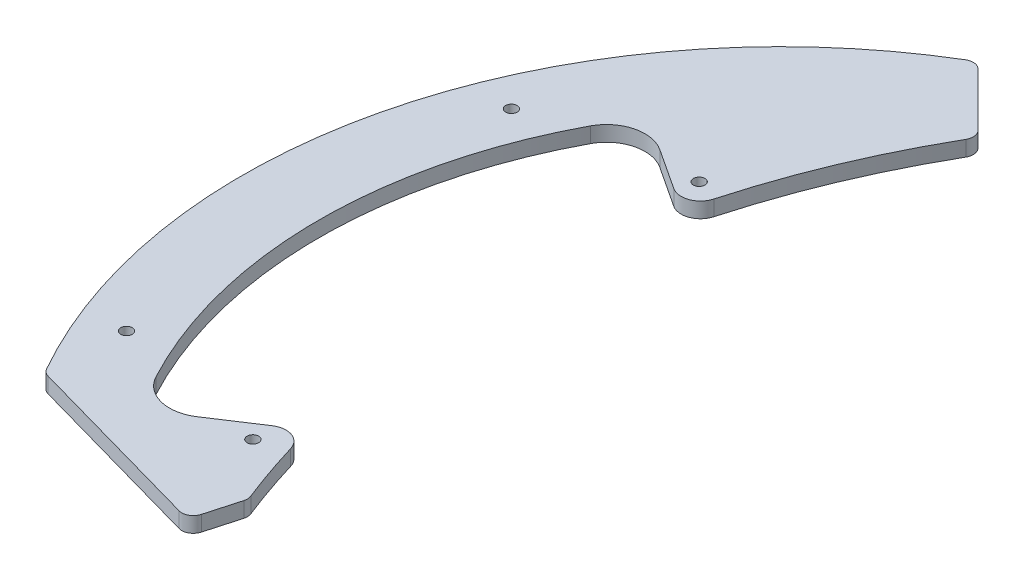
ISO-10303-21;
HEADER;
FILE_DESCRIPTION(('STEP AP214'),'2;1');
FILE_NAME('part.step','',(''),(''),'','','');
FILE_SCHEMA(('AUTOMOTIVE_DESIGN { 1 0 10303 214 1 1 1 1 }'));
ENDSEC;
DATA;
#1=APPLICATION_CONTEXT('core data for automotive mechanical design processes');
#2=APPLICATION_PROTOCOL_DEFINITION('international standard','automotive_design',2000,#1);
#3=PRODUCT_CONTEXT('',#1,'mechanical');
#4=PRODUCT('Part','Part','',(#3));
#5=PRODUCT_RELATED_PRODUCT_CATEGORY('part','',(#4));
#6=PRODUCT_DEFINITION_FORMATION('','',#4);
#7=PRODUCT_DEFINITION_CONTEXT('part definition',#1,'design');
#8=PRODUCT_DEFINITION('design','',#6,#7);
#9=PRODUCT_DEFINITION_SHAPE('','',#8);
#10=(LENGTH_UNIT() NAMED_UNIT(*) SI_UNIT(.MILLI.,.METRE.));
#11=(NAMED_UNIT(*) PLANE_ANGLE_UNIT() SI_UNIT($,.RADIAN.));
#12=(NAMED_UNIT(*) SI_UNIT($,.STERADIAN.) SOLID_ANGLE_UNIT());
#13=UNCERTAINTY_MEASURE_WITH_UNIT(LENGTH_MEASURE(1.E-05),#10,'distance_accuracy_value','');
#14=(GEOMETRIC_REPRESENTATION_CONTEXT(3) GLOBAL_UNCERTAINTY_ASSIGNED_CONTEXT((#13)) GLOBAL_UNIT_ASSIGNED_CONTEXT((#10,
#11,#12)) REPRESENTATION_CONTEXT('',''));
#15=CARTESIAN_POINT('',(0.,0.,0.));
#16=DIRECTION('',(0.,0.,1.));
#17=DIRECTION('',(1.,0.,0.));
#18=AXIS2_PLACEMENT_3D('',#15,#16,#17);
#19=CARTESIAN_POINT('',(119.292781216644,442.462940593629,-2.48826461253128));
#20=DIRECTION('',(0.,-1.,0.));
#21=DIRECTION('',(0.,0.,-1.));
#22=AXIS2_PLACEMENT_3D('',#19,#20,#21);
#23=CYLINDRICAL_SURFACE('',#22,200.);
#24=CARTESIAN_POINT('',(119.292781216644,4.,-2.48826461253128));
#25=DIRECTION('',(0.,1.,0.));
#26=DIRECTION('',(0.,0.,1.));
#27=AXIS2_PLACEMENT_3D('',#24,#25,#26);
#28=CIRCLE('',#27,200.);
#29=CARTESIAN_POINT('',(-66.7091969028402,4.,71.0186339456232));
#30=VERTEX_POINT('',#29);
#31=CARTESIAN_POINT('',(-72.2325146751866,4.,55.1143484666219));
#32=VERTEX_POINT('',#31);
#33=EDGE_CURVE('E191',#30,#32,#28,.F.);
#34=ORIENTED_EDGE('',*,*,#33,.F.);
#35=DIRECTION('',(0.,-1.,0.));
#36=VECTOR('',#35,1.);
#37=CARTESIAN_POINT('',(-66.7091969028402,442.462940593629,71.0186339456232));
#38=LINE('',#37,#36);
#39=CARTESIAN_POINT('',(-66.7091969028402,0.,71.0186339456232));
#40=VERTEX_POINT('',#39);
#41=EDGE_CURVE('E287',#30,#40,#38,.T.);
#42=ORIENTED_EDGE('',*,*,#41,.T.);
#43=CARTESIAN_POINT('',(119.292781216644,0.,-2.48826461253128));
#44=DIRECTION('',(0.,1.,0.));
#45=DIRECTION('',(0.,0.,1.));
#46=AXIS2_PLACEMENT_3D('',#43,#44,#45);
#47=CIRCLE('',#46,200.);
#48=CARTESIAN_POINT('',(-72.2325146751866,0.,55.1143484666219));
#49=VERTEX_POINT('',#48);
#50=EDGE_CURVE('E184',#40,#49,#47,.F.);
#51=ORIENTED_EDGE('',*,*,#50,.T.);
#52=DIRECTION('',(0.,-1.,0.));
#53=VECTOR('',#52,1.);
#54=CARTESIAN_POINT('',(-72.2325146751866,442.462940593629,55.1143484666219));
#55=LINE('',#54,#53);
#56=EDGE_CURVE('E234',#49,#32,#55,.F.);
#57=ORIENTED_EDGE('',*,*,#56,.T.);
#58=EDGE_LOOP('',(#34,#42,#51,#57));
#59=FACE_BOUND('',#58,.T.);
#60=ADVANCED_FACE('F33',(#59),#23,.F.);
#61=CARTESIAN_POINT('',(0.,4.,0.));
#62=DIRECTION('',(0.,1.,0.));
#63=DIRECTION('',(0.,0.,1.));
#64=AXIS2_PLACEMENT_3D('',#61,#62,#63);
#65=PLANE('',#64);
#66=CARTESIAN_POINT('',(-120.,4.,50.));
#67=DIRECTION('',(0.,1.,0.));
#68=DIRECTION('',(0.,0.,1.));
#69=AXIS2_PLACEMENT_3D('',#66,#67,#68);
#70=CIRCLE('',#69,1.5);
#71=CARTESIAN_POINT('',(-120.,4.,51.5));
#72=VERTEX_POINT('',#71);
#73=EDGE_CURVE('E441',#72,#72,#70,.T.);
#74=ORIENTED_EDGE('',*,*,#73,.F.);
#75=EDGE_LOOP('',(#74));
#76=FACE_BOUND('',#75,.T.);
#77=CARTESIAN_POINT('',(-120.,4.,-50.));
#78=DIRECTION('',(0.,1.,0.));
#79=DIRECTION('',(0.,0.,1.));
#80=AXIS2_PLACEMENT_3D('',#77,#78,#79);
#81=CIRCLE('',#80,1.5);
#82=CARTESIAN_POINT('',(-120.,4.,-48.5));
#83=VERTEX_POINT('',#82);
#84=EDGE_CURVE('E433',#83,#83,#81,.T.);
#85=ORIENTED_EDGE('',*,*,#84,.F.);
#86=EDGE_LOOP('',(#85));
#87=FACE_BOUND('',#86,.T.);
#88=CARTESIAN_POINT('',(-73.4125931453854,4.,-56.0105841810066));
#89=VERTEX_POINT('',#88);
#90=CARTESIAN_POINT('',(-54.0840870386816,4.,-102.190127955076));
#91=VERTEX_POINT('',#90);
#92=EDGE_CURVE('E178',#89,#91,#28,.F.);
#93=ORIENTED_EDGE('',*,*,#92,.T.);
#94=CARTESIAN_POINT('',(-56.6847400625115,4.,-103.685655905214));
#95=DIRECTION('',(0.,1.,0.));
#96=DIRECTION('',(0.,0.,1.));
#97=AXIS2_PLACEMENT_3D('',#94,#95,#96);
#98=CIRCLE('',#97,3.);
#99=CARTESIAN_POINT('',(-54.5634197189519,4.,-105.806976248773));
#100=VERTEX_POINT('',#99);
#101=EDGE_CURVE('E280',#91,#100,#98,.T.);
#102=ORIENTED_EDGE('',*,*,#101,.T.);
#103=DIRECTION('',(0.707106781186548,0.,0.707106781186547));
#104=VECTOR('',#103,1.);
#105=CARTESIAN_POINT('',(-70.,4.,-121.243556529821));
#106=LINE('',#105,#104);
#107=CARTESIAN_POINT('',(-68.3581583039485,4.,-119.60171483377));
#108=VERTEX_POINT('',#107);
#109=EDGE_CURVE('E197',#108,#100,#106,.T.);
#110=ORIENTED_EDGE('',*,*,#109,.F.);
#111=CARTESIAN_POINT('',(-70.4794786475082,4.,-117.48039449021));
#112=DIRECTION('',(0.,1.,0.));
#113=DIRECTION('',(0.,0.,1.));
#114=AXIS2_PLACEMENT_3D('',#111,#112,#113);
#115=CIRCLE('',#114,3.);
#116=CARTESIAN_POINT('',(-72.0228248952639,4.,-120.052957873208));
#117=VERTEX_POINT('',#116);
#118=EDGE_CURVE('E278',#108,#117,#115,.T.);
#119=ORIENTED_EDGE('',*,*,#118,.T.);
#120=CARTESIAN_POINT('',(0.,4.,0.));
#121=DIRECTION('',(0.,1.,0.));
#122=DIRECTION('',(0.,0.,1.));
#123=AXIS2_PLACEMENT_3D('',#120,#121,#122);
#124=CIRCLE('',#123,140.);
#125=CARTESIAN_POINT('',(-121.860234865542,4.,68.9208470530874));
#126=VERTEX_POINT('',#125);
#127=EDGE_CURVE('E219',#117,#126,#124,.T.);
#128=ORIENTED_EDGE('',*,*,#127,.T.);
#129=CARTESIAN_POINT('',(-119.248944118423,4.,67.4439717590927));
#130=DIRECTION('',(0.,1.,0.));
#131=DIRECTION('',(0.,0.,1.));
#132=AXIS2_PLACEMENT_3D('',#129,#130,#131);
#133=CIRCLE('',#132,3.);
#134=CARTESIAN_POINT('',(-120.059781260619,4.,70.3323178479186));
#135=VERTEX_POINT('',#134);
#136=EDGE_CURVE('E273',#126,#135,#133,.T.);
#137=ORIENTED_EDGE('',*,*,#136,.T.);
#138=DIRECTION('',(0.962782029608611,0.,0.270279047398653));
#139=VECTOR('',#138,1.);
#140=CARTESIAN_POINT('',(-50.,4.,90.));
#141=LINE('',#140,#139);
#142=CARTESIAN_POINT('',(-72.7272013836813,4.,83.6198577132606));
#143=VERTEX_POINT('',#142);
#144=EDGE_CURVE('E212',#135,#143,#141,.T.);
#145=ORIENTED_EDGE('',*,*,#144,.T.);
#146=CARTESIAN_POINT('',(-71.9163642414853,4.,80.7315116244347));
#147=DIRECTION('',(0.,1.,0.));
#148=DIRECTION('',(0.,0.,1.));
#149=AXIS2_PLACEMENT_3D('',#146,#147,#148);
#150=CIRCLE('',#149,3.);
#151=CARTESIAN_POINT('',(-69.0280181526595,4.,81.5423487666307));
#152=VERTEX_POINT('',#151);
#153=EDGE_CURVE('E275',#143,#152,#150,.T.);
#154=ORIENTED_EDGE('',*,*,#153,.T.);
#155=DIRECTION('',(0.270279047398657,0.,-0.96278202960861));
#156=VECTOR('',#155,1.);
#157=CARTESIAN_POINT('',(-42.7665342383547,4.,-12.0057269236563));
#158=LINE('',#157,#156);
#159=CARTESIAN_POINT('',(-66.6108804858067,4.,72.9320745661915));
#160=VERTEX_POINT('',#159);
#161=EDGE_CURVE('E195',#152,#160,#158,.T.);
#162=ORIENTED_EDGE('',*,*,#161,.T.);
#163=CARTESIAN_POINT('',(-69.4992265746324,4.,72.1212374239956));
#164=DIRECTION('',(0.,1.,0.));
#165=DIRECTION('',(0.,0.,1.));
#166=AXIS2_PLACEMENT_3D('',#163,#164,#165);
#167=CIRCLE('',#166,3.);
#168=EDGE_CURVE('E48',#160,#30,#167,.T.);
#169=ORIENTED_EDGE('',*,*,#168,.T.);
#170=ORIENTED_EDGE('',*,*,#33,.T.);
#171=CARTESIAN_POINT('',(-77.0206470724824,4.,56.5544137936007));
#172=DIRECTION('',(0.,1.,0.));
#173=DIRECTION('',(0.,0.,1.));
#174=AXIS2_PLACEMENT_3D('',#171,#172,#173);
#175=CIRCLE('',#174,5.);
#176=CARTESIAN_POINT('',(-79.7649948281515,4.,52.3748736997681));
#177=VERTEX_POINT('',#176);
#178=EDGE_CURVE('E229',#32,#177,#175,.T.);
#179=ORIENTED_EDGE('',*,*,#178,.T.);
#180=DIRECTION('',(0.835908018766511,0.,-0.548869551133825));
#181=VECTOR('',#180,1.);
#182=CARTESIAN_POINT('',(-100.308962251981,4.,65.864346136059));
#183=LINE('',#182,#181);
#184=CARTESIAN_POINT('',(-91.569135575574,4.,60.1256468567463));
#185=VERTEX_POINT('',#184);
#186=EDGE_CURVE('E326',#185,#177,#183,.T.);
#187=ORIENTED_EDGE('',*,*,#186,.F.);
#188=CARTESIAN_POINT('',(-97.0578310869122,4.,51.7665666690812));
#189=DIRECTION('',(0.,1.,0.));
#190=DIRECTION('',(0.,0.,1.));
#191=AXIS2_PLACEMENT_3D('',#188,#189,#190);
#192=CIRCLE('',#191,10.);
#193=CARTESIAN_POINT('',(-105.881270276631,4.,56.4726181844522));
#194=VERTEX_POINT('',#193);
#195=EDGE_CURVE('E253',#185,#194,#192,.F.);
#196=ORIENTED_EDGE('',*,*,#195,.T.);
#197=CARTESIAN_POINT('',(0.,4.,0.));
#198=DIRECTION('',(0.,1.,0.));
#199=DIRECTION('',(0.,0.,1.));
#200=AXIS2_PLACEMENT_3D('',#197,#198,#199);
#201=CIRCLE('',#200,120.);
#202=CARTESIAN_POINT('',(-105.881270276631,4.,-56.4726181844522));
#203=VERTEX_POINT('',#202);
#204=EDGE_CURVE('E187',#203,#194,#201,.T.);
#205=ORIENTED_EDGE('',*,*,#204,.F.);
#206=CARTESIAN_POINT('',(-97.0578310869122,4.,-51.7665666690812));
#207=DIRECTION('',(0.,1.,0.));
#208=DIRECTION('',(0.,0.,1.));
#209=AXIS2_PLACEMENT_3D('',#206,#207,#208);
#210=CIRCLE('',#209,10.);
#211=CARTESIAN_POINT('',(-91.569135575574,4.,-60.1256468567463));
#212=VERTEX_POINT('',#211);
#213=EDGE_CURVE('E249',#203,#212,#210,.F.);
#214=ORIENTED_EDGE('',*,*,#213,.T.);
#215=DIRECTION('',(-0.835908018766511,0.,-0.548869551133825));
#216=VECTOR('',#215,1.);
#217=CARTESIAN_POINT('',(0.,4.,0.));
#218=LINE('',#217,#216);
#219=CARTESIAN_POINT('',(-80.9745752601053,4.,-53.1691020763859));
#220=VERTEX_POINT('',#219);
#221=EDGE_CURVE('E330',#220,#212,#218,.T.);
#222=ORIENTED_EDGE('',*,*,#221,.F.);
#223=CARTESIAN_POINT('',(-78.2302275044362,4.,-57.3486421702185));
#224=DIRECTION('',(0.,1.,0.));
#225=DIRECTION('',(0.,0.,1.));
#226=AXIS2_PLACEMENT_3D('',#223,#224,#225);
#227=CIRCLE('',#226,5.);
#228=EDGE_CURVE('E232',#220,#89,#227,.T.);
#229=ORIENTED_EDGE('',*,*,#228,.T.);
#230=EDGE_LOOP('',(#93,#102,#110,#119,#128,#137,#145,#154,#162,#169,#170,#179,#187,#196,#205,
#214,#222,#229));
#231=FACE_BOUND('',#230,.T.);
#232=CARTESIAN_POINT('',(-79.1959594928934,4.,-57.9827560572969));
#233=DIRECTION('',(0.,1.,0.));
#234=DIRECTION('',(0.,0.,1.));
#235=AXIS2_PLACEMENT_3D('',#232,#233,#234);
#236=CIRCLE('',#235,1.49999999999998);
#237=CARTESIAN_POINT('',(-79.1959594928934,4.,-56.482756057297));
#238=VERTEX_POINT('',#237);
#239=EDGE_CURVE('E200',#238,#238,#236,.T.);
#240=ORIENTED_EDGE('',*,*,#239,.F.);
#241=EDGE_LOOP('',(#240));
#242=FACE_BOUND('',#241,.T.);
#243=CARTESIAN_POINT('',(-79.1959594928934,4.,57.982756057297));
#244=DIRECTION('',(0.,1.,0.));
#245=DIRECTION('',(0.,0.,1.));
#246=AXIS2_PLACEMENT_3D('',#243,#244,#245);
#247=CIRCLE('',#246,1.50000000000001);
#248=CARTESIAN_POINT('',(-79.1959594928934,4.,59.482756057297));
#249=VERTEX_POINT('',#248);
#250=EDGE_CURVE('E206',#249,#249,#247,.T.);
#251=ORIENTED_EDGE('',*,*,#250,.F.);
#252=EDGE_LOOP('',(#251));
#253=FACE_BOUND('',#252,.T.);
#254=ADVANCED_FACE('F309',(#76,#87,#231,#242,#253),#65,.T.);
#255=CARTESIAN_POINT('',(0.,0.,0.));
#256=DIRECTION('',(0.,1.,0.));
#257=DIRECTION('',(0.,0.,1.));
#258=AXIS2_PLACEMENT_3D('',#255,#256,#257);
#259=PLANE('',#258);
#260=CARTESIAN_POINT('',(-120.,0.,50.));
#261=DIRECTION('',(0.,1.,0.));
#262=DIRECTION('',(0.,0.,1.));
#263=AXIS2_PLACEMENT_3D('',#260,#261,#262);
#264=CIRCLE('',#263,1.5);
#265=CARTESIAN_POINT('',(-120.,0.,51.5));
#266=VERTEX_POINT('',#265);
#267=EDGE_CURVE('E438',#266,#266,#264,.F.);
#268=ORIENTED_EDGE('',*,*,#267,.F.);
#269=EDGE_LOOP('',(#268));
#270=FACE_BOUND('',#269,.T.);
#271=CARTESIAN_POINT('',(-120.,0.,-50.));
#272=DIRECTION('',(0.,1.,0.));
#273=DIRECTION('',(0.,0.,1.));
#274=AXIS2_PLACEMENT_3D('',#271,#272,#273);
#275=CIRCLE('',#274,1.5);
#276=CARTESIAN_POINT('',(-120.,0.,-48.5));
#277=VERTEX_POINT('',#276);
#278=EDGE_CURVE('E431',#277,#277,#275,.F.);
#279=ORIENTED_EDGE('',*,*,#278,.F.);
#280=EDGE_LOOP('',(#279));
#281=FACE_BOUND('',#280,.T.);
#282=CARTESIAN_POINT('',(-79.1959594928934,0.,-57.9827560572969));
#283=DIRECTION('',(0.,1.,0.));
#284=DIRECTION('',(0.,0.,1.));
#285=AXIS2_PLACEMENT_3D('',#282,#283,#284);
#286=CIRCLE('',#285,1.49999999999998);
#287=CARTESIAN_POINT('',(-79.1959594928934,0.,-56.482756057297));
#288=VERTEX_POINT('',#287);
#289=EDGE_CURVE('E203',#288,#288,#286,.F.);
#290=ORIENTED_EDGE('',*,*,#289,.F.);
#291=EDGE_LOOP('',(#290));
#292=FACE_BOUND('',#291,.T.);
#293=CARTESIAN_POINT('',(-79.1959594928934,0.,57.982756057297));
#294=DIRECTION('',(0.,1.,0.));
#295=DIRECTION('',(0.,0.,1.));
#296=AXIS2_PLACEMENT_3D('',#293,#294,#295);
#297=CIRCLE('',#296,1.50000000000001);
#298=CARTESIAN_POINT('',(-79.1959594928934,0.,59.482756057297));
#299=VERTEX_POINT('',#298);
#300=EDGE_CURVE('E209',#299,#299,#297,.F.);
#301=ORIENTED_EDGE('',*,*,#300,.F.);
#302=EDGE_LOOP('',(#301));
#303=FACE_BOUND('',#302,.T.);
#304=DIRECTION('',(-0.707106781186548,0.,-0.707106781186547));
#305=VECTOR('',#304,1.);
#306=CARTESIAN_POINT('',(25.6217782649107,0.,-25.6217782649108));
#307=LINE('',#306,#305);
#308=CARTESIAN_POINT('',(-54.5634197189519,0.,-105.806976248773));
#309=VERTEX_POINT('',#308);
#310=CARTESIAN_POINT('',(-68.3581583039485,0.,-119.60171483377));
#311=VERTEX_POINT('',#310);
#312=EDGE_CURVE('E179',#309,#311,#307,.T.);
#313=ORIENTED_EDGE('',*,*,#312,.F.);
#314=CARTESIAN_POINT('',(-56.6847400625115,0.,-103.685655905214));
#315=DIRECTION('',(0.,1.,0.));
#316=DIRECTION('',(0.,0.,1.));
#317=AXIS2_PLACEMENT_3D('',#314,#315,#316);
#318=CIRCLE('',#317,3.);
#319=CARTESIAN_POINT('',(-54.0840870386816,0.,-102.190127955076));
#320=VERTEX_POINT('',#319);
#321=EDGE_CURVE('E183',#309,#320,#318,.F.);
#322=ORIENTED_EDGE('',*,*,#321,.T.);
#323=CARTESIAN_POINT('',(-73.4125931453854,0.,-56.0105841810066));
#324=VERTEX_POINT('',#323);
#325=EDGE_CURVE('E175',#324,#320,#47,.F.);
#326=ORIENTED_EDGE('',*,*,#325,.F.);
#327=CARTESIAN_POINT('',(-78.2302275044362,0.,-57.3486421702185));
#328=DIRECTION('',(0.,1.,0.));
#329=DIRECTION('',(0.,0.,1.));
#330=AXIS2_PLACEMENT_3D('',#327,#328,#329);
#331=CIRCLE('',#330,5.);
#332=CARTESIAN_POINT('',(-80.9745752601053,0.,-53.1691020763859));
#333=VERTEX_POINT('',#332);
#334=EDGE_CURVE('E160',#324,#333,#331,.F.);
#335=ORIENTED_EDGE('',*,*,#334,.T.);
#336=DIRECTION('',(0.835908018766511,0.,0.548869551133825));
#337=VECTOR('',#336,1.);
#338=CARTESIAN_POINT('',(0.,0.,0.));
#339=LINE('',#338,#337);
#340=CARTESIAN_POINT('',(-91.569135575574,0.,-60.1256468567463));
#341=VERTEX_POINT('',#340);
#342=EDGE_CURVE('E185',#341,#333,#339,.T.);
#343=ORIENTED_EDGE('',*,*,#342,.F.);
#344=CARTESIAN_POINT('',(-97.0578310869122,0.,-51.7665666690812));
#345=DIRECTION('',(0.,1.,0.));
#346=DIRECTION('',(0.,0.,1.));
#347=AXIS2_PLACEMENT_3D('',#344,#345,#346);
#348=CIRCLE('',#347,10.);
#349=CARTESIAN_POINT('',(-105.881270276631,0.,-56.4726181844522));
#350=VERTEX_POINT('',#349);
#351=EDGE_CURVE('E251',#341,#350,#348,.T.);
#352=ORIENTED_EDGE('',*,*,#351,.T.);
#353=CARTESIAN_POINT('',(0.,0.,0.));
#354=DIRECTION('',(0.,1.,0.));
#355=DIRECTION('',(0.,0.,1.));
#356=AXIS2_PLACEMENT_3D('',#353,#354,#355);
#357=CIRCLE('',#356,120.);
#358=CARTESIAN_POINT('',(-105.881270276631,0.,56.4726181844522));
#359=VERTEX_POINT('',#358);
#360=EDGE_CURVE('E334',#359,#350,#357,.F.);
#361=ORIENTED_EDGE('',*,*,#360,.F.);
#362=CARTESIAN_POINT('',(-97.0578310869122,0.,51.7665666690812));
#363=DIRECTION('',(0.,1.,0.));
#364=DIRECTION('',(0.,0.,1.));
#365=AXIS2_PLACEMENT_3D('',#362,#363,#364);
#366=CIRCLE('',#365,10.);
#367=CARTESIAN_POINT('',(-91.569135575574,0.,60.1256468567463));
#368=VERTEX_POINT('',#367);
#369=EDGE_CURVE('E255',#359,#368,#366,.T.);
#370=ORIENTED_EDGE('',*,*,#369,.T.);
#371=DIRECTION('',(-0.835908018766511,0.,0.548869551133825));
#372=VECTOR('',#371,1.);
#373=CARTESIAN_POINT('',(-100.308962251981,0.,65.864346136059));
#374=LINE('',#373,#372);
#375=CARTESIAN_POINT('',(-79.7649948281515,0.,52.3748736997681));
#376=VERTEX_POINT('',#375);
#377=EDGE_CURVE('E320',#376,#368,#374,.T.);
#378=ORIENTED_EDGE('',*,*,#377,.F.);
#379=CARTESIAN_POINT('',(-77.0206470724824,0.,56.5544137936007));
#380=DIRECTION('',(0.,1.,0.));
#381=DIRECTION('',(0.,0.,1.));
#382=AXIS2_PLACEMENT_3D('',#379,#380,#381);
#383=CIRCLE('',#382,5.);
#384=EDGE_CURVE('E169',#376,#49,#383,.F.);
#385=ORIENTED_EDGE('',*,*,#384,.T.);
#386=ORIENTED_EDGE('',*,*,#50,.F.);
#387=CARTESIAN_POINT('',(-69.4992265746324,0.,72.1212374239956));
#388=DIRECTION('',(0.,1.,0.));
#389=DIRECTION('',(0.,0.,1.));
#390=AXIS2_PLACEMENT_3D('',#387,#388,#389);
#391=CIRCLE('',#390,3.);
#392=CARTESIAN_POINT('',(-66.6108804858067,0.,72.9320745661915));
#393=VERTEX_POINT('',#392);
#394=EDGE_CURVE('E266',#40,#393,#391,.F.);
#395=ORIENTED_EDGE('',*,*,#394,.T.);
#396=DIRECTION('',(0.270279047398657,0.,-0.96278202960861));
#397=VECTOR('',#396,1.);
#398=CARTESIAN_POINT('',(-42.7665342383547,0.,-12.0057269236563));
#399=LINE('',#398,#397);
#400=CARTESIAN_POINT('',(-69.0280181526595,0.,81.5423487666307));
#401=VERTEX_POINT('',#400);
#402=EDGE_CURVE('E193',#401,#393,#399,.T.);
#403=ORIENTED_EDGE('',*,*,#402,.F.);
#404=CARTESIAN_POINT('',(-71.9163642414853,0.,80.7315116244347));
#405=DIRECTION('',(0.,1.,0.));
#406=DIRECTION('',(0.,0.,1.));
#407=AXIS2_PLACEMENT_3D('',#404,#405,#406);
#408=CIRCLE('',#407,3.);
#409=CARTESIAN_POINT('',(-72.7272013836813,0.,83.6198577132606));
#410=VERTEX_POINT('',#409);
#411=EDGE_CURVE('E264',#401,#410,#408,.F.);
#412=ORIENTED_EDGE('',*,*,#411,.T.);
#413=DIRECTION('',(0.962782029608611,0.,0.270279047398653));
#414=VECTOR('',#413,1.);
#415=CARTESIAN_POINT('',(-50.,0.,90.));
#416=LINE('',#415,#414);
#417=CARTESIAN_POINT('',(-120.059781260619,0.,70.3323178479186));
#418=VERTEX_POINT('',#417);
#419=EDGE_CURVE('E215',#418,#410,#416,.T.);
#420=ORIENTED_EDGE('',*,*,#419,.F.);
#421=CARTESIAN_POINT('',(-119.248944118423,0.,67.4439717590927));
#422=DIRECTION('',(0.,1.,0.));
#423=DIRECTION('',(0.,0.,1.));
#424=AXIS2_PLACEMENT_3D('',#421,#422,#423);
#425=CIRCLE('',#424,3.);
#426=CARTESIAN_POINT('',(-121.860234865542,0.,68.9208470530874));
#427=VERTEX_POINT('',#426);
#428=EDGE_CURVE('E262',#418,#427,#425,.F.);
#429=ORIENTED_EDGE('',*,*,#428,.T.);
#430=CARTESIAN_POINT('',(0.,0.,0.));
#431=DIRECTION('',(0.,1.,0.));
#432=DIRECTION('',(0.,0.,1.));
#433=AXIS2_PLACEMENT_3D('',#430,#431,#432);
#434=CIRCLE('',#433,140.);
#435=CARTESIAN_POINT('',(-72.0228248952639,0.,-120.052957873208));
#436=VERTEX_POINT('',#435);
#437=EDGE_CURVE('E218',#436,#427,#434,.T.);
#438=ORIENTED_EDGE('',*,*,#437,.F.);
#439=CARTESIAN_POINT('',(-70.4794786475082,0.,-117.48039449021));
#440=DIRECTION('',(0.,1.,0.));
#441=DIRECTION('',(0.,0.,1.));
#442=AXIS2_PLACEMENT_3D('',#439,#440,#441);
#443=CIRCLE('',#442,3.);
#444=EDGE_CURVE('E268',#436,#311,#443,.F.);
#445=ORIENTED_EDGE('',*,*,#444,.T.);
#446=EDGE_LOOP('',(#313,#322,#326,#335,#343,#352,#361,#370,#378,#385,#386,#395,#403,#412,#420,
#429,#438,#445));
#447=FACE_BOUND('',#446,.T.);
#448=ADVANCED_FACE('F182',(#270,#281,#292,#303,#447),#259,.F.);
#449=CARTESIAN_POINT('',(-50.,4.001,90.));
#450=DIRECTION('',(0.270279047398653,0.,-0.962782029608611));
#451=DIRECTION('',(-0.962782029608611,0.,-0.270279047398653));
#452=AXIS2_PLACEMENT_3D('',#449,#450,#451);
#453=PLANE('',#452);
#454=ORIENTED_EDGE('',*,*,#419,.T.);
#455=DIRECTION('',(0.,-1.,0.));
#456=VECTOR('',#455,1.);
#457=CARTESIAN_POINT('',(-72.7272013836813,4.,83.6198577132606));
#458=LINE('',#457,#456);
#459=EDGE_CURVE('E11',#410,#143,#458,.F.);
#460=ORIENTED_EDGE('',*,*,#459,.T.);
#461=ORIENTED_EDGE('',*,*,#144,.F.);
#462=DIRECTION('',(0.,-1.,0.));
#463=VECTOR('',#462,1.);
#464=CARTESIAN_POINT('',(-120.059781260619,4.001,70.3323178479186));
#465=LINE('',#464,#463);
#466=EDGE_CURVE('E41',#135,#418,#465,.T.);
#467=ORIENTED_EDGE('',*,*,#466,.T.);
#468=EDGE_LOOP('',(#454,#460,#461,#467));
#469=FACE_BOUND('',#468,.T.);
#470=ADVANCED_FACE('F298',(#469),#453,.F.);
#471=CARTESIAN_POINT('',(0.,4.,0.));
#472=DIRECTION('',(0.,-1.,0.));
#473=DIRECTION('',(0.,0.,-1.));
#474=AXIS2_PLACEMENT_3D('',#471,#472,#473);
#475=CYLINDRICAL_SURFACE('',#474,140.);
#476=ORIENTED_EDGE('',*,*,#127,.F.);
#477=DIRECTION('',(0.,-1.,0.));
#478=VECTOR('',#477,1.);
#479=CARTESIAN_POINT('',(-72.0228248952639,4.,-120.052957873208));
#480=LINE('',#479,#478);
#481=EDGE_CURVE('E284',#117,#436,#480,.T.);
#482=ORIENTED_EDGE('',*,*,#481,.T.);
#483=ORIENTED_EDGE('',*,*,#437,.T.);
#484=DIRECTION('',(0.,-1.,0.));
#485=VECTOR('',#484,1.);
#486=CARTESIAN_POINT('',(-121.860234865542,4.,68.9208470530874));
#487=LINE('',#486,#485);
#488=EDGE_CURVE('E282',#427,#126,#487,.F.);
#489=ORIENTED_EDGE('',*,*,#488,.T.);
#490=EDGE_LOOP('',(#476,#482,#483,#489));
#491=FACE_BOUND('',#490,.T.);
#492=ADVANCED_FACE('F382',(#491),#475,.T.);
#493=CARTESIAN_POINT('',(-79.1959594928934,-0.00100000000000013,57.982756057297));
#494=DIRECTION('',(0.,1.,0.));
#495=DIRECTION('',(0.,0.,1.));
#496=AXIS2_PLACEMENT_3D('',#493,#494,#495);
#497=CYLINDRICAL_SURFACE('',#496,1.50000000000001);
#498=ORIENTED_EDGE('',*,*,#250,.T.);
#499=EDGE_LOOP('',(#498));
#500=FACE_BOUND('',#499,.T.);
#501=ORIENTED_EDGE('',*,*,#300,.T.);
#502=EDGE_LOOP('',(#501));
#503=FACE_BOUND('',#502,.T.);
#504=ADVANCED_FACE('F376',(#500,#503),#497,.F.);
#505=CARTESIAN_POINT('',(-79.1959594928934,-0.00100000000000013,-57.9827560572969));
#506=DIRECTION('',(0.,1.,0.));
#507=DIRECTION('',(0.,0.,1.));
#508=AXIS2_PLACEMENT_3D('',#505,#506,#507);
#509=CYLINDRICAL_SURFACE('',#508,1.49999999999998);
#510=ORIENTED_EDGE('',*,*,#239,.T.);
#511=EDGE_LOOP('',(#510));
#512=FACE_BOUND('',#511,.T.);
#513=ORIENTED_EDGE('',*,*,#289,.T.);
#514=EDGE_LOOP('',(#513));
#515=FACE_BOUND('',#514,.T.);
#516=ADVANCED_FACE('F370',(#512,#515),#509,.F.);
#517=CARTESIAN_POINT('',(-70.,4.,-121.243556529821));
#518=DIRECTION('',(0.707106781186547,0.,-0.707106781186548));
#519=DIRECTION('',(-0.707106781186548,0.,-0.707106781186547));
#520=AXIS2_PLACEMENT_3D('',#517,#518,#519);
#521=PLANE('',#520);
#522=ORIENTED_EDGE('',*,*,#109,.T.);
#523=DIRECTION('',(0.,-1.,0.));
#524=VECTOR('',#523,1.);
#525=CARTESIAN_POINT('',(-54.5634197189519,4.,-105.806976248773));
#526=LINE('',#525,#524);
#527=EDGE_CURVE('E259',#100,#309,#526,.T.);
#528=ORIENTED_EDGE('',*,*,#527,.T.);
#529=ORIENTED_EDGE('',*,*,#312,.T.);
#530=DIRECTION('',(0.,1.,0.));
#531=VECTOR('',#530,1.);
#532=CARTESIAN_POINT('',(-68.3581583039485,4.,-119.60171483377));
#533=LINE('',#532,#531);
#534=EDGE_CURVE('E257',#311,#108,#533,.T.);
#535=ORIENTED_EDGE('',*,*,#534,.T.);
#536=EDGE_LOOP('',(#522,#528,#529,#535));
#537=FACE_BOUND('',#536,.T.);
#538=ADVANCED_FACE('F366',(#537),#521,.T.);
#539=ORIENTED_EDGE('',*,*,#325,.T.);
#540=DIRECTION('',(0.,-1.,0.));
#541=VECTOR('',#540,1.);
#542=CARTESIAN_POINT('',(-54.0840870386816,442.462940593629,-102.190127955076));
#543=LINE('',#542,#541);
#544=EDGE_CURVE('E271',#320,#91,#543,.F.);
#545=ORIENTED_EDGE('',*,*,#544,.T.);
#546=ORIENTED_EDGE('',*,*,#92,.F.);
#547=DIRECTION('',(0.,-1.,0.));
#548=VECTOR('',#547,1.);
#549=CARTESIAN_POINT('',(-73.4125931453854,442.462940593629,-56.0105841810066));
#550=LINE('',#549,#548);
#551=EDGE_CURVE('E164',#89,#324,#550,.T.);
#552=ORIENTED_EDGE('',*,*,#551,.T.);
#553=EDGE_LOOP('',(#539,#545,#546,#552));
#554=FACE_BOUND('',#553,.T.);
#555=ADVANCED_FACE('F174',(#554),#23,.F.);
#556=CARTESIAN_POINT('',(-66.3365195012217,442.462940593629,71.9547519504486));
#557=DIRECTION('',(0.96278202960861,0.,0.270279047398657));
#558=DIRECTION('',(0.270279047398657,0.,-0.96278202960861));
#559=AXIS2_PLACEMENT_3D('',#556,#557,#558);
#560=PLANE('',#559);
#561=ORIENTED_EDGE('',*,*,#402,.T.);
#562=DIRECTION('',(0.,-1.,0.));
#563=VECTOR('',#562,1.);
#564=CARTESIAN_POINT('',(-66.6108804858067,442.462940593629,72.9320745661915));
#565=LINE('',#564,#563);
#566=EDGE_CURVE('E56',#393,#160,#565,.F.);
#567=ORIENTED_EDGE('',*,*,#566,.T.);
#568=ORIENTED_EDGE('',*,*,#161,.F.);
#569=DIRECTION('',(0.,-1.,0.));
#570=VECTOR('',#569,1.);
#571=CARTESIAN_POINT('',(-69.0280181526595,0.,81.5423487666307));
#572=LINE('',#571,#570);
#573=EDGE_CURVE('E290',#152,#401,#572,.T.);
#574=ORIENTED_EDGE('',*,*,#573,.T.);
#575=EDGE_LOOP('',(#561,#567,#568,#574));
#576=FACE_BOUND('',#575,.T.);
#577=ADVANCED_FACE('F308',(#576),#560,.T.);
#578=CARTESIAN_POINT('',(-100.308962251981,-0.00100000000000013,65.864346136059));
#579=DIRECTION('',(0.548869551133825,0.,0.835908018766511));
#580=DIRECTION('',(0.835908018766511,0.,-0.548869551133825));
#581=AXIS2_PLACEMENT_3D('',#578,#579,#580);
#582=PLANE('',#581);
#583=ORIENTED_EDGE('',*,*,#377,.T.);
#584=DIRECTION('',(0.,-1.,0.));
#585=VECTOR('',#584,1.);
#586=CARTESIAN_POINT('',(-91.569135575574,4.,60.1256468567463));
#587=LINE('',#586,#585);
#588=EDGE_CURVE('E246',#368,#185,#587,.F.);
#589=ORIENTED_EDGE('',*,*,#588,.T.);
#590=ORIENTED_EDGE('',*,*,#186,.T.);
#591=DIRECTION('',(0.,1.,0.));
#592=VECTOR('',#591,1.);
#593=CARTESIAN_POINT('',(-79.7649948281515,0.,52.3748736997681));
#594=LINE('',#593,#592);
#595=EDGE_CURVE('E237',#177,#376,#594,.F.);
#596=ORIENTED_EDGE('',*,*,#595,.T.);
#597=EDGE_LOOP('',(#583,#589,#590,#596));
#598=FACE_BOUND('',#597,.T.);
#599=ADVANCED_FACE('F347',(#598),#582,.F.);
#600=CARTESIAN_POINT('',(0.,-0.00100000000000013,0.));
#601=DIRECTION('',(0.,1.,0.));
#602=DIRECTION('',(0.,0.,1.));
#603=AXIS2_PLACEMENT_3D('',#600,#601,#602);
#604=CYLINDRICAL_SURFACE('',#603,120.);
#605=ORIENTED_EDGE('',*,*,#360,.T.);
#606=DIRECTION('',(0.,1.,0.));
#607=VECTOR('',#606,1.);
#608=CARTESIAN_POINT('',(-105.881270276631,-0.00100000000000013,-56.4726181844522));
#609=LINE('',#608,#607);
#610=EDGE_CURVE('E241',#350,#203,#609,.T.);
#611=ORIENTED_EDGE('',*,*,#610,.T.);
#612=ORIENTED_EDGE('',*,*,#204,.T.);
#613=DIRECTION('',(0.,1.,0.));
#614=VECTOR('',#613,1.);
#615=CARTESIAN_POINT('',(-105.881270276631,-0.00100000000000013,56.4726181844522));
#616=LINE('',#615,#614);
#617=EDGE_CURVE('E239',#194,#359,#616,.F.);
#618=ORIENTED_EDGE('',*,*,#617,.T.);
#619=EDGE_LOOP('',(#605,#611,#612,#618));
#620=FACE_BOUND('',#619,.T.);
#621=ADVANCED_FACE('F340',(#620),#604,.F.);
#622=CARTESIAN_POINT('',(0.,-0.00100000000000013,0.));
#623=DIRECTION('',(0.548869551133825,0.,-0.835908018766511));
#624=DIRECTION('',(-0.835908018766511,0.,-0.548869551133825));
#625=AXIS2_PLACEMENT_3D('',#622,#623,#624);
#626=PLANE('',#625);
#627=ORIENTED_EDGE('',*,*,#221,.T.);
#628=DIRECTION('',(0.,-1.,0.));
#629=VECTOR('',#628,1.);
#630=CARTESIAN_POINT('',(-91.569135575574,0.,-60.1256468567463));
#631=LINE('',#630,#629);
#632=EDGE_CURVE('E244',#212,#341,#631,.T.);
#633=ORIENTED_EDGE('',*,*,#632,.T.);
#634=ORIENTED_EDGE('',*,*,#342,.T.);
#635=DIRECTION('',(0.,1.,0.));
#636=VECTOR('',#635,1.);
#637=CARTESIAN_POINT('',(-80.9745752601053,4.,-53.1691020763859));
#638=LINE('',#637,#636);
#639=EDGE_CURVE('E165',#333,#220,#638,.T.);
#640=ORIENTED_EDGE('',*,*,#639,.T.);
#641=EDGE_LOOP('',(#627,#633,#634,#640));
#642=FACE_BOUND('',#641,.T.);
#643=ADVANCED_FACE('F354',(#642),#626,.F.);
#644=CARTESIAN_POINT('',(-78.2302275044362,442.462940593629,-57.3486421702185));
#645=DIRECTION('',(0.,-1.,0.));
#646=DIRECTION('',(0.,0.,-1.));
#647=AXIS2_PLACEMENT_3D('',#644,#645,#646);
#648=CYLINDRICAL_SURFACE('',#647,5.);
#649=ORIENTED_EDGE('',*,*,#228,.F.);
#650=ORIENTED_EDGE('',*,*,#639,.F.);
#651=ORIENTED_EDGE('',*,*,#334,.F.);
#652=ORIENTED_EDGE('',*,*,#551,.F.);
#653=EDGE_LOOP('',(#649,#650,#651,#652));
#654=FACE_BOUND('',#653,.T.);
#655=ADVANCED_FACE('F163',(#654),#648,.T.);
#656=CARTESIAN_POINT('',(-77.0206470724824,442.462940593629,56.5544137936007));
#657=DIRECTION('',(0.,-1.,0.));
#658=DIRECTION('',(0.,0.,-1.));
#659=AXIS2_PLACEMENT_3D('',#656,#657,#658);
#660=CYLINDRICAL_SURFACE('',#659,5.);
#661=ORIENTED_EDGE('',*,*,#384,.F.);
#662=ORIENTED_EDGE('',*,*,#595,.F.);
#663=ORIENTED_EDGE('',*,*,#178,.F.);
#664=ORIENTED_EDGE('',*,*,#56,.F.);
#665=EDGE_LOOP('',(#661,#662,#663,#664));
#666=FACE_BOUND('',#665,.T.);
#667=ADVANCED_FACE('F324',(#666),#660,.T.);
#668=CARTESIAN_POINT('',(-97.0578310869122,-0.00100000000000013,-51.7665666690812));
#669=DIRECTION('',(0.,1.,0.));
#670=DIRECTION('',(0.,0.,1.));
#671=AXIS2_PLACEMENT_3D('',#668,#669,#670);
#672=CYLINDRICAL_SURFACE('',#671,10.);
#673=ORIENTED_EDGE('',*,*,#351,.F.);
#674=ORIENTED_EDGE('',*,*,#632,.F.);
#675=ORIENTED_EDGE('',*,*,#213,.F.);
#676=ORIENTED_EDGE('',*,*,#610,.F.);
#677=EDGE_LOOP('',(#673,#674,#675,#676));
#678=FACE_BOUND('',#677,.T.);
#679=ADVANCED_FACE('F396',(#678),#672,.F.);
#680=CARTESIAN_POINT('',(-97.0578310869122,-0.00100000000000013,51.7665666690812));
#681=DIRECTION('',(0.,1.,0.));
#682=DIRECTION('',(0.,0.,1.));
#683=AXIS2_PLACEMENT_3D('',#680,#681,#682);
#684=CYLINDRICAL_SURFACE('',#683,10.);
#685=ORIENTED_EDGE('',*,*,#369,.F.);
#686=ORIENTED_EDGE('',*,*,#617,.F.);
#687=ORIENTED_EDGE('',*,*,#195,.F.);
#688=ORIENTED_EDGE('',*,*,#588,.F.);
#689=EDGE_LOOP('',(#685,#686,#687,#688));
#690=FACE_BOUND('',#689,.T.);
#691=ADVANCED_FACE('F345',(#690),#684,.F.);
#692=CARTESIAN_POINT('',(-120.,-0.00100000000000013,-50.));
#693=DIRECTION('',(0.,1.,0.));
#694=DIRECTION('',(0.,0.,1.));
#695=AXIS2_PLACEMENT_3D('',#692,#693,#694);
#696=CYLINDRICAL_SURFACE('',#695,1.5);
#697=ORIENTED_EDGE('',*,*,#84,.T.);
#698=EDGE_LOOP('',(#697));
#699=FACE_BOUND('',#698,.T.);
#700=ORIENTED_EDGE('',*,*,#278,.T.);
#701=EDGE_LOOP('',(#700));
#702=FACE_BOUND('',#701,.T.);
#703=ADVANCED_FACE('F402',(#699,#702),#696,.F.);
#704=CARTESIAN_POINT('',(-120.,-0.00100000000000013,50.));
#705=DIRECTION('',(0.,1.,0.));
#706=DIRECTION('',(0.,0.,1.));
#707=AXIS2_PLACEMENT_3D('',#704,#705,#706);
#708=CYLINDRICAL_SURFACE('',#707,1.5);
#709=ORIENTED_EDGE('',*,*,#73,.T.);
#710=EDGE_LOOP('',(#709));
#711=FACE_BOUND('',#710,.T.);
#712=ORIENTED_EDGE('',*,*,#267,.T.);
#713=EDGE_LOOP('',(#712));
#714=FACE_BOUND('',#713,.T.);
#715=ADVANCED_FACE('F407',(#711,#714),#708,.F.);
#716=CARTESIAN_POINT('',(-56.6847400625115,442.462940593629,-103.685655905214));
#717=DIRECTION('',(0.,-1.,0.));
#718=DIRECTION('',(0.,0.,-1.));
#719=AXIS2_PLACEMENT_3D('',#716,#717,#718);
#720=CYLINDRICAL_SURFACE('',#719,3.);
#721=ORIENTED_EDGE('',*,*,#101,.F.);
#722=ORIENTED_EDGE('',*,*,#544,.F.);
#723=ORIENTED_EDGE('',*,*,#321,.F.);
#724=ORIENTED_EDGE('',*,*,#527,.F.);
#725=EDGE_LOOP('',(#721,#722,#723,#724));
#726=FACE_BOUND('',#725,.T.);
#727=ADVANCED_FACE('F403',(#726),#720,.T.);
#728=CARTESIAN_POINT('',(-70.4794786475082,4.,-117.48039449021));
#729=DIRECTION('',(0.,-1.,0.));
#730=DIRECTION('',(0.,0.,-1.));
#731=AXIS2_PLACEMENT_3D('',#728,#729,#730);
#732=CYLINDRICAL_SURFACE('',#731,3.);
#733=ORIENTED_EDGE('',*,*,#118,.F.);
#734=ORIENTED_EDGE('',*,*,#534,.F.);
#735=ORIENTED_EDGE('',*,*,#444,.F.);
#736=ORIENTED_EDGE('',*,*,#481,.F.);
#737=EDGE_LOOP('',(#733,#734,#735,#736));
#738=FACE_BOUND('',#737,.T.);
#739=ADVANCED_FACE('F406',(#738),#732,.T.);
#740=CARTESIAN_POINT('',(-69.4992265746324,442.462940593629,72.1212374239956));
#741=DIRECTION('',(0.,-1.,0.));
#742=DIRECTION('',(0.,0.,-1.));
#743=AXIS2_PLACEMENT_3D('',#740,#741,#742);
#744=CYLINDRICAL_SURFACE('',#743,3.);
#745=ORIENTED_EDGE('',*,*,#168,.F.);
#746=ORIENTED_EDGE('',*,*,#566,.F.);
#747=ORIENTED_EDGE('',*,*,#394,.F.);
#748=ORIENTED_EDGE('',*,*,#41,.F.);
#749=EDGE_LOOP('',(#745,#746,#747,#748));
#750=FACE_BOUND('',#749,.T.);
#751=ADVANCED_FACE('F313',(#750),#744,.T.);
#752=CARTESIAN_POINT('',(-71.9163642414853,442.462940593629,80.7315116244347));
#753=DIRECTION('',(0.,1.,0.));
#754=DIRECTION('',(0.,0.,1.));
#755=AXIS2_PLACEMENT_3D('',#752,#753,#754);
#756=CYLINDRICAL_SURFACE('',#755,3.);
#757=ORIENTED_EDGE('',*,*,#153,.F.);
#758=ORIENTED_EDGE('',*,*,#459,.F.);
#759=ORIENTED_EDGE('',*,*,#411,.F.);
#760=ORIENTED_EDGE('',*,*,#573,.F.);
#761=EDGE_LOOP('',(#757,#758,#759,#760));
#762=FACE_BOUND('',#761,.T.);
#763=ADVANCED_FACE('F307',(#762),#756,.T.);
#764=CARTESIAN_POINT('',(-119.248944118423,4.,67.4439717590927));
#765=DIRECTION('',(0.,-1.,0.));
#766=DIRECTION('',(0.,0.,-1.));
#767=AXIS2_PLACEMENT_3D('',#764,#765,#766);
#768=CYLINDRICAL_SURFACE('',#767,3.);
#769=ORIENTED_EDGE('',*,*,#136,.F.);
#770=ORIENTED_EDGE('',*,*,#488,.F.);
#771=ORIENTED_EDGE('',*,*,#428,.F.);
#772=ORIENTED_EDGE('',*,*,#466,.F.);
#773=EDGE_LOOP('',(#769,#770,#771,#772));
#774=FACE_BOUND('',#773,.T.);
#775=ADVANCED_FACE('F35',(#774),#768,.T.);
#776=CLOSED_SHELL('',(#60,#254,#448,#470,#492,#504,#516,#538,#555,#577,#599,#621,#643,#655,#667,
#679,#691,#703,#715,#727,#739,#751,#763,#775));
#777=MANIFOLD_SOLID_BREP('B2',#776);
#778=ADVANCED_BREP_SHAPE_REPRESENTATION('',(#18,#777),#14);
#779=SHAPE_DEFINITION_REPRESENTATION(#9,#778);
ENDSEC;
END-ISO-10303-21;
